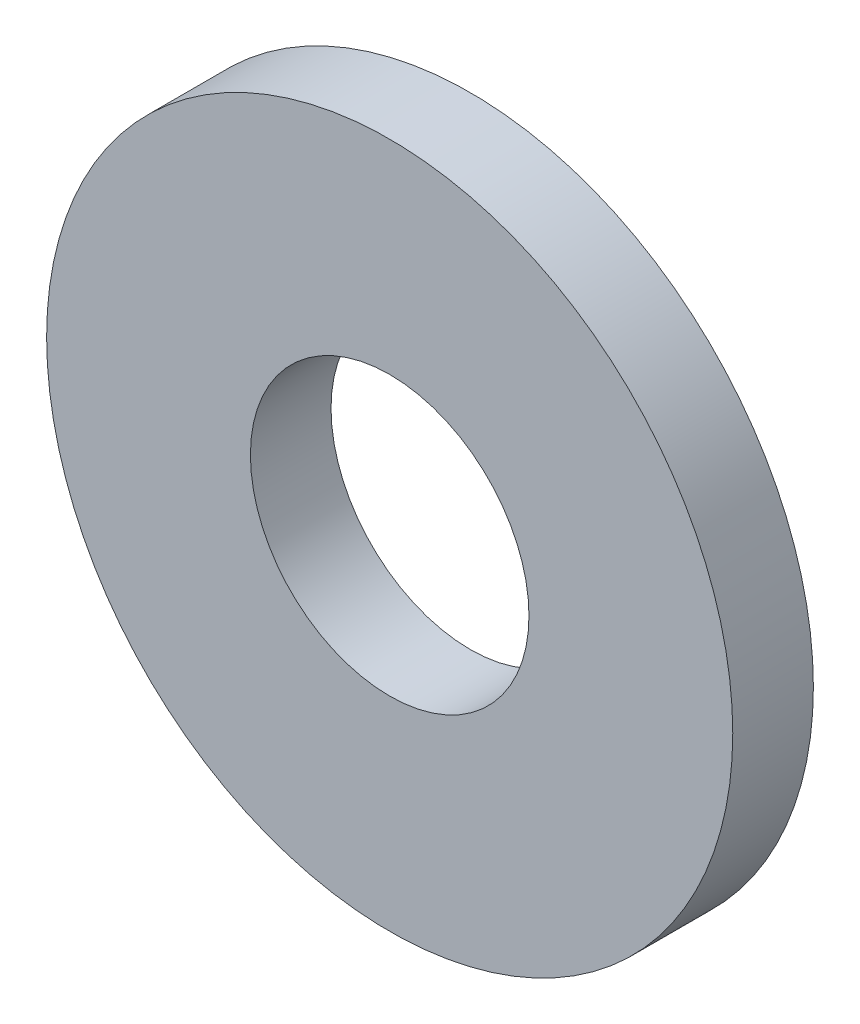
ISO-10303-21;
HEADER;
FILE_DESCRIPTION(('STEP AP214'),'2;1');
FILE_NAME('part.step','',(''),(''),'','','');
FILE_SCHEMA(('AUTOMOTIVE_DESIGN { 1 0 10303 214 1 1 1 1 }'));
ENDSEC;
DATA;
#1=APPLICATION_CONTEXT('core data for automotive mechanical design processes');
#2=APPLICATION_PROTOCOL_DEFINITION('international standard','automotive_design',2000,#1);
#3=PRODUCT_CONTEXT('',#1,'mechanical');
#4=PRODUCT('Part','Part','',(#3));
#5=PRODUCT_RELATED_PRODUCT_CATEGORY('part','',(#4));
#6=PRODUCT_DEFINITION_FORMATION('','',#4);
#7=PRODUCT_DEFINITION_CONTEXT('part definition',#1,'design');
#8=PRODUCT_DEFINITION('design','',#6,#7);
#9=PRODUCT_DEFINITION_SHAPE('','',#8);
#10=(LENGTH_UNIT() NAMED_UNIT(*) SI_UNIT(.MILLI.,.METRE.));
#11=(NAMED_UNIT(*) PLANE_ANGLE_UNIT() SI_UNIT($,.RADIAN.));
#12=(NAMED_UNIT(*) SI_UNIT($,.STERADIAN.) SOLID_ANGLE_UNIT());
#13=UNCERTAINTY_MEASURE_WITH_UNIT(LENGTH_MEASURE(1.E-05),#10,'distance_accuracy_value','');
#14=(GEOMETRIC_REPRESENTATION_CONTEXT(3) GLOBAL_UNCERTAINTY_ASSIGNED_CONTEXT((#13)) GLOBAL_UNIT_ASSIGNED_CONTEXT((#10,
#11,#12)) REPRESENTATION_CONTEXT('',''));
#15=CARTESIAN_POINT('',(0.,0.,0.));
#16=DIRECTION('',(0.,0.,1.));
#17=DIRECTION('',(1.,0.,0.));
#18=AXIS2_PLACEMENT_3D('',#15,#16,#17);
#19=CARTESIAN_POINT('',(0.,0.,1.49225));
#20=DIRECTION('',(0.,0.,1.));
#21=DIRECTION('',(1.,0.,0.));
#22=AXIS2_PLACEMENT_3D('',#19,#20,#21);
#23=PLANE('',#22);
#24=CARTESIAN_POINT('',(0.,0.,1.49225));
#25=DIRECTION('',(0.,0.,1.));
#26=DIRECTION('',(1.,0.,0.));
#27=AXIS2_PLACEMENT_3D('',#24,#25,#26);
#28=CIRCLE('',#27,12.7);
#29=CARTESIAN_POINT('',(12.7,0.,1.49225));
#30=VERTEX_POINT('',#29);
#31=EDGE_CURVE('E10',#30,#30,#28,.T.);
#32=ORIENTED_EDGE('',*,*,#31,.T.);
#33=EDGE_LOOP('',(#32));
#34=FACE_BOUND('',#33,.T.);
#35=CARTESIAN_POINT('',(0.,0.,1.49225));
#36=DIRECTION('',(0.,0.,1.));
#37=DIRECTION('',(1.,0.,0.));
#38=AXIS2_PLACEMENT_3D('',#35,#36,#37);
#39=CIRCLE('',#38,5.1562);
#40=CARTESIAN_POINT('',(5.1562,0.,1.49225));
#41=VERTEX_POINT('',#40);
#42=EDGE_CURVE('E39',#41,#41,#39,.T.);
#43=ORIENTED_EDGE('',*,*,#42,.F.);
#44=EDGE_LOOP('',(#43));
#45=FACE_BOUND('',#44,.T.);
#46=ADVANCED_FACE('F28',(#34,#45),#23,.T.);
#47=CARTESIAN_POINT('',(0.,0.,-1.49225));
#48=DIRECTION('',(0.,0.,1.));
#49=DIRECTION('',(1.,0.,0.));
#50=AXIS2_PLACEMENT_3D('',#47,#48,#49);
#51=PLANE('',#50);
#52=CARTESIAN_POINT('',(0.,0.,-1.49225));
#53=DIRECTION('',(0.,0.,1.));
#54=DIRECTION('',(1.,0.,0.));
#55=AXIS2_PLACEMENT_3D('',#52,#53,#54);
#56=CIRCLE('',#55,12.7);
#57=CARTESIAN_POINT('',(12.7,0.,-1.49225));
#58=VERTEX_POINT('',#57);
#59=EDGE_CURVE('E32',#58,#58,#56,.T.);
#60=ORIENTED_EDGE('',*,*,#59,.F.);
#61=EDGE_LOOP('',(#60));
#62=FACE_BOUND('',#61,.T.);
#63=CARTESIAN_POINT('',(0.,0.,-1.49225));
#64=DIRECTION('',(0.,0.,1.));
#65=DIRECTION('',(1.,0.,0.));
#66=AXIS2_PLACEMENT_3D('',#63,#64,#65);
#67=CIRCLE('',#66,5.1562);
#68=CARTESIAN_POINT('',(5.1562,0.,-1.49225));
#69=VERTEX_POINT('',#68);
#70=EDGE_CURVE('E41',#69,#69,#67,.T.);
#71=ORIENTED_EDGE('',*,*,#70,.T.);
#72=EDGE_LOOP('',(#71));
#73=FACE_BOUND('',#72,.T.);
#74=ADVANCED_FACE('F51',(#62,#73),#51,.F.);
#75=CARTESIAN_POINT('',(0.,0.,1.49225));
#76=DIRECTION('',(0.,0.,-1.));
#77=DIRECTION('',(-1.,0.,0.));
#78=AXIS2_PLACEMENT_3D('',#75,#76,#77);
#79=CYLINDRICAL_SURFACE('',#78,12.7);
#80=ORIENTED_EDGE('',*,*,#31,.F.);
#81=EDGE_LOOP('',(#80));
#82=FACE_BOUND('',#81,.T.);
#83=ORIENTED_EDGE('',*,*,#59,.T.);
#84=EDGE_LOOP('',(#83));
#85=FACE_BOUND('',#84,.T.);
#86=ADVANCED_FACE('F30',(#82,#85),#79,.T.);
#87=CARTESIAN_POINT('',(0.,0.,1.49225));
#88=DIRECTION('',(0.,0.,-1.));
#89=DIRECTION('',(-1.,0.,0.));
#90=AXIS2_PLACEMENT_3D('',#87,#88,#89);
#91=CYLINDRICAL_SURFACE('',#90,5.1562);
#92=ORIENTED_EDGE('',*,*,#42,.T.);
#93=EDGE_LOOP('',(#92));
#94=FACE_BOUND('',#93,.T.);
#95=ORIENTED_EDGE('',*,*,#70,.F.);
#96=EDGE_LOOP('',(#95));
#97=FACE_BOUND('',#96,.T.);
#98=ADVANCED_FACE('F47',(#94,#97),#91,.F.);
#99=CLOSED_SHELL('',(#46,#74,#86,#98));
#100=MANIFOLD_SOLID_BREP('B2',#99);
#101=ADVANCED_BREP_SHAPE_REPRESENTATION('',(#18,#100),#14);
#102=SHAPE_DEFINITION_REPRESENTATION(#9,#101);
ENDSEC;
END-ISO-10303-21;
